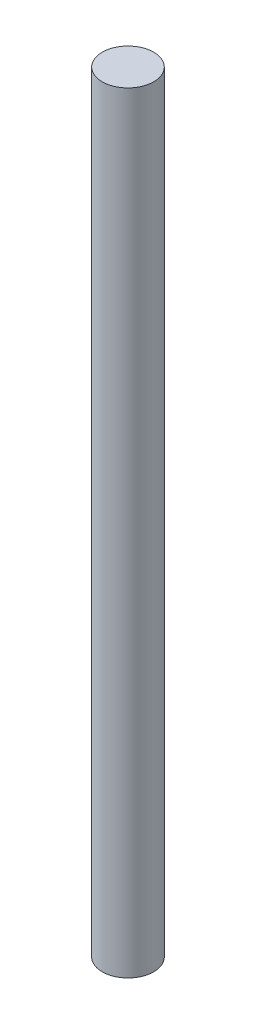
ISO-10303-21;
HEADER;
FILE_DESCRIPTION(('STEP AP214'),'2;1');
FILE_NAME('part.step','',(''),(''),'','','');
FILE_SCHEMA(('AUTOMOTIVE_DESIGN { 1 0 10303 214 1 1 1 1 }'));
ENDSEC;
DATA;
#1=APPLICATION_CONTEXT('core data for automotive mechanical design processes');
#2=APPLICATION_PROTOCOL_DEFINITION('international standard','automotive_design',2000,#1);
#3=PRODUCT_CONTEXT('',#1,'mechanical');
#4=PRODUCT('Part','Part','',(#3));
#5=PRODUCT_RELATED_PRODUCT_CATEGORY('part','',(#4));
#6=PRODUCT_DEFINITION_FORMATION('','',#4);
#7=PRODUCT_DEFINITION_CONTEXT('part definition',#1,'design');
#8=PRODUCT_DEFINITION('design','',#6,#7);
#9=PRODUCT_DEFINITION_SHAPE('','',#8);
#10=(LENGTH_UNIT() NAMED_UNIT(*) SI_UNIT(.MILLI.,.METRE.));
#11=(NAMED_UNIT(*) PLANE_ANGLE_UNIT() SI_UNIT($,.RADIAN.));
#12=(NAMED_UNIT(*) SI_UNIT($,.STERADIAN.) SOLID_ANGLE_UNIT());
#13=UNCERTAINTY_MEASURE_WITH_UNIT(LENGTH_MEASURE(1.E-05),#10,'distance_accuracy_value','');
#14=(GEOMETRIC_REPRESENTATION_CONTEXT(3) GLOBAL_UNCERTAINTY_ASSIGNED_CONTEXT((#13)) GLOBAL_UNIT_ASSIGNED_CONTEXT((#10,
#11,#12)) REPRESENTATION_CONTEXT('',''));
#15=CARTESIAN_POINT('',(0.,0.,0.));
#16=DIRECTION('',(0.,0.,1.));
#17=DIRECTION('',(1.,0.,0.));
#18=AXIS2_PLACEMENT_3D('',#15,#16,#17);
#19=CARTESIAN_POINT('',(0.,150.,0.));
#20=DIRECTION('',(0.,-1.,0.));
#21=DIRECTION('',(0.,0.,-1.));
#22=AXIS2_PLACEMENT_3D('',#19,#20,#21);
#23=CYLINDRICAL_SURFACE('',#22,5.);
#24=CARTESIAN_POINT('',(0.,150.,0.));
#25=DIRECTION('',(0.,1.,0.));
#26=DIRECTION('',(0.,0.,1.));
#27=AXIS2_PLACEMENT_3D('',#24,#25,#26);
#28=CIRCLE('',#27,5.);
#29=CARTESIAN_POINT('',(0.,150.,5.));
#30=VERTEX_POINT('',#29);
#31=EDGE_CURVE('E10',#30,#30,#28,.T.);
#32=ORIENTED_EDGE('',*,*,#31,.F.);
#33=EDGE_LOOP('',(#32));
#34=FACE_BOUND('',#33,.T.);
#35=CARTESIAN_POINT('',(0.,0.,0.));
#36=DIRECTION('',(0.,1.,0.));
#37=DIRECTION('',(0.,0.,1.));
#38=AXIS2_PLACEMENT_3D('',#35,#36,#37);
#39=CIRCLE('',#38,5.);
#40=CARTESIAN_POINT('',(0.,0.,5.));
#41=VERTEX_POINT('',#40);
#42=EDGE_CURVE('E46',#41,#41,#39,.T.);
#43=ORIENTED_EDGE('',*,*,#42,.T.);
#44=EDGE_LOOP('',(#43));
#45=FACE_BOUND('',#44,.T.);
#46=ADVANCED_FACE('F43',(#34,#45),#23,.T.);
#47=CARTESIAN_POINT('',(0.,150.,0.));
#48=DIRECTION('',(0.,1.,0.));
#49=DIRECTION('',(0.,0.,1.));
#50=AXIS2_PLACEMENT_3D('',#47,#48,#49);
#51=PLANE('',#50);
#52=ORIENTED_EDGE('',*,*,#31,.T.);
#53=EDGE_LOOP('',(#52));
#54=FACE_BOUND('',#53,.T.);
#55=ADVANCED_FACE('F60',(#54),#51,.T.);
#56=CARTESIAN_POINT('',(0.,0.,0.));
#57=DIRECTION('',(0.,1.,0.));
#58=DIRECTION('',(0.,0.,1.));
#59=AXIS2_PLACEMENT_3D('',#56,#57,#58);
#60=PLANE('',#59);
#61=ORIENTED_EDGE('',*,*,#42,.F.);
#62=EDGE_LOOP('',(#61));
#63=FACE_BOUND('',#62,.T.);
#64=ADVANCED_FACE('F58',(#63),#60,.F.);
#65=CLOSED_SHELL('',(#46,#55,#64));
#66=MANIFOLD_SOLID_BREP('B2',#65);
#67=ADVANCED_BREP_SHAPE_REPRESENTATION('',(#18,#66),#14);
#68=SHAPE_DEFINITION_REPRESENTATION(#9,#67);
ENDSEC;
END-ISO-10303-21;
